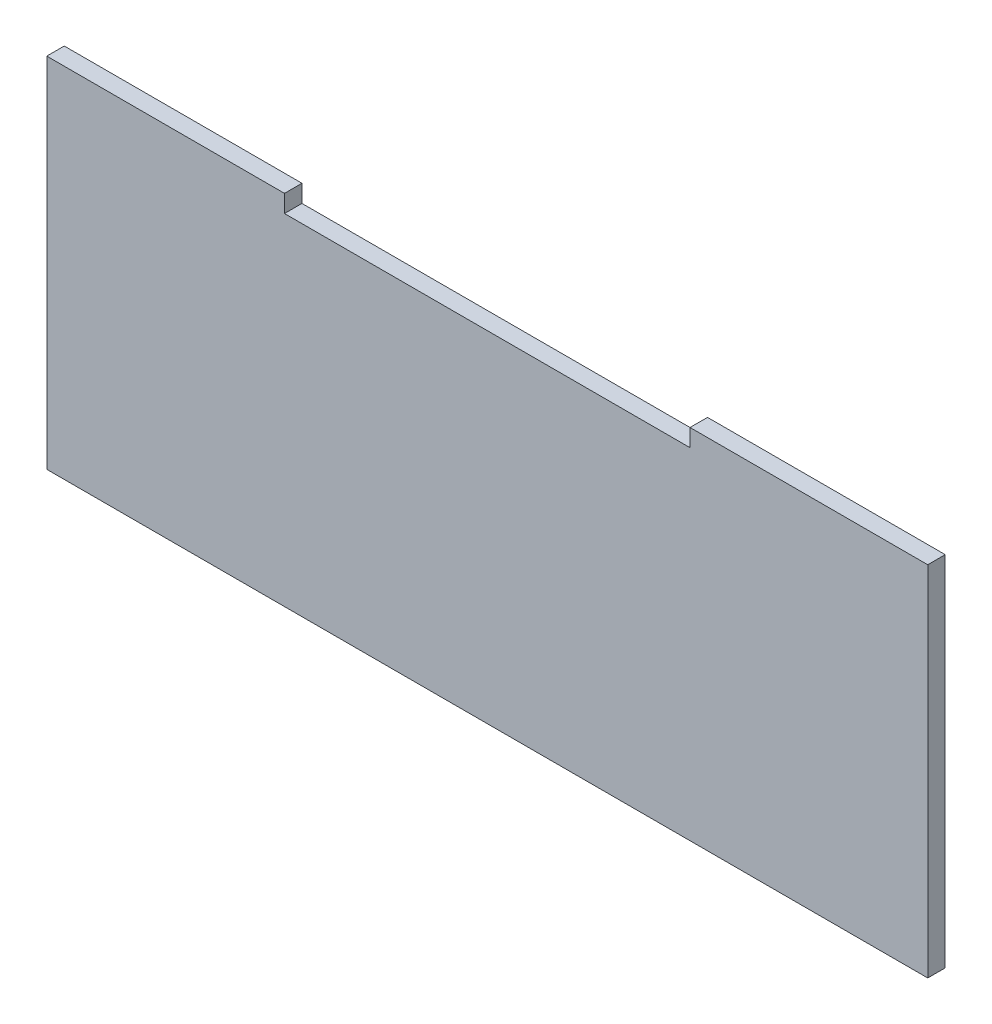
ISO-10303-21;
HEADER;
FILE_DESCRIPTION(('STEP AP214'),'2;1');
FILE_NAME('part.step','',(''),(''),'','','');
FILE_SCHEMA(('AUTOMOTIVE_DESIGN { 1 0 10303 214 1 1 1 1 }'));
ENDSEC;
DATA;
#1=APPLICATION_CONTEXT('core data for automotive mechanical design processes');
#2=APPLICATION_PROTOCOL_DEFINITION('international standard','automotive_design',2000,#1);
#3=PRODUCT_CONTEXT('',#1,'mechanical');
#4=PRODUCT('Part','Part','',(#3));
#5=PRODUCT_RELATED_PRODUCT_CATEGORY('part','',(#4));
#6=PRODUCT_DEFINITION_FORMATION('','',#4);
#7=PRODUCT_DEFINITION_CONTEXT('part definition',#1,'design');
#8=PRODUCT_DEFINITION('design','',#6,#7);
#9=PRODUCT_DEFINITION_SHAPE('','',#8);
#10=(LENGTH_UNIT() NAMED_UNIT(*) SI_UNIT(.MILLI.,.METRE.));
#11=(NAMED_UNIT(*) PLANE_ANGLE_UNIT() SI_UNIT($,.RADIAN.));
#12=(NAMED_UNIT(*) SI_UNIT($,.STERADIAN.) SOLID_ANGLE_UNIT());
#13=UNCERTAINTY_MEASURE_WITH_UNIT(LENGTH_MEASURE(1.E-05),#10,'distance_accuracy_value','');
#14=(GEOMETRIC_REPRESENTATION_CONTEXT(3) GLOBAL_UNCERTAINTY_ASSIGNED_CONTEXT((#13)) GLOBAL_UNIT_ASSIGNED_CONTEXT((#10,
#11,#12)) REPRESENTATION_CONTEXT('',''));
#15=CARTESIAN_POINT('',(0.,0.,0.));
#16=DIRECTION('',(0.,0.,1.));
#17=DIRECTION('',(1.,0.,0.));
#18=AXIS2_PLACEMENT_3D('',#15,#16,#17);
#19=CARTESIAN_POINT('',(0.,0.,3.175));
#20=DIRECTION('',(0.,1.,0.));
#21=DIRECTION('',(0.,0.,1.));
#22=AXIS2_PLACEMENT_3D('',#19,#20,#21);
#23=PLANE('',#22);
#24=DIRECTION('',(1.,0.,0.));
#25=VECTOR('',#24,1.);
#26=CARTESIAN_POINT('',(0.,0.,0.));
#27=LINE('',#26,#25);
#28=CARTESIAN_POINT('',(-80.,0.,0.));
#29=VERTEX_POINT('',#28);
#30=CARTESIAN_POINT('',(80.,0.,0.));
#31=VERTEX_POINT('',#30);
#32=EDGE_CURVE('E85',#29,#31,#27,.T.);
#33=ORIENTED_EDGE('',*,*,#32,.T.);
#34=DIRECTION('',(0.,0.,-1.));
#35=VECTOR('',#34,1.);
#36=CARTESIAN_POINT('',(80.,0.,3.175));
#37=LINE('',#36,#35);
#38=CARTESIAN_POINT('',(80.,0.,3.175));
#39=VERTEX_POINT('',#38);
#40=EDGE_CURVE('E11',#39,#31,#37,.T.);
#41=ORIENTED_EDGE('',*,*,#40,.F.);
#42=DIRECTION('',(1.,0.,0.));
#43=VECTOR('',#42,1.);
#44=CARTESIAN_POINT('',(0.,0.,3.175));
#45=LINE('',#44,#43);
#46=CARTESIAN_POINT('',(-80.,0.,3.175));
#47=VERTEX_POINT('',#46);
#48=EDGE_CURVE('E91',#47,#39,#45,.T.);
#49=ORIENTED_EDGE('',*,*,#48,.F.);
#50=DIRECTION('',(0.,0.,-1.));
#51=VECTOR('',#50,1.);
#52=CARTESIAN_POINT('',(-80.,0.,3.175));
#53=LINE('',#52,#51);
#54=EDGE_CURVE('E125',#47,#29,#53,.T.);
#55=ORIENTED_EDGE('',*,*,#54,.T.);
#56=EDGE_LOOP('',(#33,#41,#49,#55));
#57=FACE_BOUND('',#56,.T.);
#58=ADVANCED_FACE('F33',(#57),#23,.F.);
#59=CARTESIAN_POINT('',(80.,65.,3.175));
#60=DIRECTION('',(-1.,0.,0.));
#61=DIRECTION('',(0.,0.,1.));
#62=AXIS2_PLACEMENT_3D('',#59,#60,#61);
#63=PLANE('',#62);
#64=DIRECTION('',(0.,1.,0.));
#65=VECTOR('',#64,1.);
#66=CARTESIAN_POINT('',(80.,65.,0.));
#67=LINE('',#66,#65);
#68=CARTESIAN_POINT('',(80.,65.,0.));
#69=VERTEX_POINT('',#68);
#70=EDGE_CURVE('E130',#31,#69,#67,.T.);
#71=ORIENTED_EDGE('',*,*,#70,.T.);
#72=DIRECTION('',(0.,0.,-1.));
#73=VECTOR('',#72,1.);
#74=CARTESIAN_POINT('',(80.,65.,3.175));
#75=LINE('',#74,#73);
#76=CARTESIAN_POINT('',(80.,65.,3.175));
#77=VERTEX_POINT('',#76);
#78=EDGE_CURVE('E41',#77,#69,#75,.T.);
#79=ORIENTED_EDGE('',*,*,#78,.F.);
#80=DIRECTION('',(0.,1.,0.));
#81=VECTOR('',#80,1.);
#82=CARTESIAN_POINT('',(80.,65.,3.175));
#83=LINE('',#82,#81);
#84=EDGE_CURVE('E174',#39,#77,#83,.T.);
#85=ORIENTED_EDGE('',*,*,#84,.F.);
#86=ORIENTED_EDGE('',*,*,#40,.T.);
#87=EDGE_LOOP('',(#71,#79,#85,#86));
#88=FACE_BOUND('',#87,.T.);
#89=ADVANCED_FACE('F176',(#88),#63,.F.);
#90=CARTESIAN_POINT('',(36.825,65.,3.175));
#91=DIRECTION('',(0.,-1.,0.));
#92=DIRECTION('',(0.,0.,-1.));
#93=AXIS2_PLACEMENT_3D('',#90,#91,#92);
#94=PLANE('',#93);
#95=DIRECTION('',(-1.,0.,0.));
#96=VECTOR('',#95,1.);
#97=CARTESIAN_POINT('',(36.825,65.,0.));
#98=LINE('',#97,#96);
#99=CARTESIAN_POINT('',(36.825,65.,0.));
#100=VERTEX_POINT('',#99);
#101=EDGE_CURVE('E132',#69,#100,#98,.T.);
#102=ORIENTED_EDGE('',*,*,#101,.T.);
#103=DIRECTION('',(0.,0.,-1.));
#104=VECTOR('',#103,1.);
#105=CARTESIAN_POINT('',(36.825,65.,3.175));
#106=LINE('',#105,#104);
#107=CARTESIAN_POINT('',(36.825,65.,3.175));
#108=VERTEX_POINT('',#107);
#109=EDGE_CURVE('E149',#108,#100,#106,.T.);
#110=ORIENTED_EDGE('',*,*,#109,.F.);
#111=DIRECTION('',(-1.,0.,0.));
#112=VECTOR('',#111,1.);
#113=CARTESIAN_POINT('',(36.825,65.,3.175));
#114=LINE('',#113,#112);
#115=EDGE_CURVE('E158',#77,#108,#114,.T.);
#116=ORIENTED_EDGE('',*,*,#115,.F.);
#117=ORIENTED_EDGE('',*,*,#78,.T.);
#118=EDGE_LOOP('',(#102,#110,#116,#117));
#119=FACE_BOUND('',#118,.T.);
#120=ADVANCED_FACE('F156',(#119),#94,.F.);
#121=CARTESIAN_POINT('',(36.825,61.825,3.175));
#122=DIRECTION('',(1.,0.,0.));
#123=DIRECTION('',(0.,1.,0.));
#124=AXIS2_PLACEMENT_3D('',#121,#122,#123);
#125=PLANE('',#124);
#126=DIRECTION('',(0.,-1.,0.));
#127=VECTOR('',#126,1.);
#128=CARTESIAN_POINT('',(36.825,61.825,0.));
#129=LINE('',#128,#127);
#130=CARTESIAN_POINT('',(36.825,61.825,0.));
#131=VERTEX_POINT('',#130);
#132=EDGE_CURVE('E134',#100,#131,#129,.T.);
#133=ORIENTED_EDGE('',*,*,#132,.T.);
#134=DIRECTION('',(0.,0.,-1.));
#135=VECTOR('',#134,1.);
#136=CARTESIAN_POINT('',(36.825,61.825,3.175));
#137=LINE('',#136,#135);
#138=CARTESIAN_POINT('',(36.825,61.825,3.175));
#139=VERTEX_POINT('',#138);
#140=EDGE_CURVE('E146',#139,#131,#137,.T.);
#141=ORIENTED_EDGE('',*,*,#140,.F.);
#142=DIRECTION('',(0.,-1.,0.));
#143=VECTOR('',#142,1.);
#144=CARTESIAN_POINT('',(36.825,61.825,3.175));
#145=LINE('',#144,#143);
#146=EDGE_CURVE('E170',#108,#139,#145,.T.);
#147=ORIENTED_EDGE('',*,*,#146,.F.);
#148=ORIENTED_EDGE('',*,*,#109,.T.);
#149=EDGE_LOOP('',(#133,#141,#147,#148));
#150=FACE_BOUND('',#149,.T.);
#151=ADVANCED_FACE('F166',(#150),#125,.F.);
#152=CARTESIAN_POINT('',(-36.825,61.825,3.175));
#153=DIRECTION('',(0.,-1.,0.));
#154=DIRECTION('',(1.,0.,0.));
#155=AXIS2_PLACEMENT_3D('',#152,#153,#154);
#156=PLANE('',#155);
#157=DIRECTION('',(-1.,0.,0.));
#158=VECTOR('',#157,1.);
#159=CARTESIAN_POINT('',(-36.825,61.825,0.));
#160=LINE('',#159,#158);
#161=CARTESIAN_POINT('',(-36.825,61.825,0.));
#162=VERTEX_POINT('',#161);
#163=EDGE_CURVE('E136',#131,#162,#160,.T.);
#164=ORIENTED_EDGE('',*,*,#163,.T.);
#165=DIRECTION('',(0.,0.,-1.));
#166=VECTOR('',#165,1.);
#167=CARTESIAN_POINT('',(-36.825,61.825,3.175));
#168=LINE('',#167,#166);
#169=CARTESIAN_POINT('',(-36.825,61.825,3.175));
#170=VERTEX_POINT('',#169);
#171=EDGE_CURVE('E120',#170,#162,#168,.T.);
#172=ORIENTED_EDGE('',*,*,#171,.F.);
#173=DIRECTION('',(-1.,0.,0.));
#174=VECTOR('',#173,1.);
#175=CARTESIAN_POINT('',(-36.825,61.825,3.175));
#176=LINE('',#175,#174);
#177=EDGE_CURVE('E111',#139,#170,#176,.T.);
#178=ORIENTED_EDGE('',*,*,#177,.F.);
#179=ORIENTED_EDGE('',*,*,#140,.T.);
#180=EDGE_LOOP('',(#164,#172,#178,#179));
#181=FACE_BOUND('',#180,.T.);
#182=ADVANCED_FACE('F169',(#181),#156,.F.);
#183=CARTESIAN_POINT('',(-36.825,65.,3.175));
#184=DIRECTION('',(-1.,0.,0.));
#185=DIRECTION('',(0.,0.,1.));
#186=AXIS2_PLACEMENT_3D('',#183,#184,#185);
#187=PLANE('',#186);
#188=DIRECTION('',(0.,1.,0.));
#189=VECTOR('',#188,1.);
#190=CARTESIAN_POINT('',(-36.825,65.,0.));
#191=LINE('',#190,#189);
#192=CARTESIAN_POINT('',(-36.825,65.,0.));
#193=VERTEX_POINT('',#192);
#194=EDGE_CURVE('E119',#162,#193,#191,.T.);
#195=ORIENTED_EDGE('',*,*,#194,.T.);
#196=DIRECTION('',(0.,0.,-1.));
#197=VECTOR('',#196,1.);
#198=CARTESIAN_POINT('',(-36.825,65.,3.175));
#199=LINE('',#198,#197);
#200=CARTESIAN_POINT('',(-36.825,65.,3.175));
#201=VERTEX_POINT('',#200);
#202=EDGE_CURVE('E116',#201,#193,#199,.T.);
#203=ORIENTED_EDGE('',*,*,#202,.F.);
#204=DIRECTION('',(0.,1.,0.));
#205=VECTOR('',#204,1.);
#206=CARTESIAN_POINT('',(-36.825,65.,3.175));
#207=LINE('',#206,#205);
#208=EDGE_CURVE('E105',#170,#201,#207,.T.);
#209=ORIENTED_EDGE('',*,*,#208,.F.);
#210=ORIENTED_EDGE('',*,*,#171,.T.);
#211=EDGE_LOOP('',(#195,#203,#209,#210));
#212=FACE_BOUND('',#211,.T.);
#213=ADVANCED_FACE('F117',(#212),#187,.F.);
#214=CARTESIAN_POINT('',(-80.,65.,3.175));
#215=DIRECTION('',(0.,-1.,0.));
#216=DIRECTION('',(0.,0.,-1.));
#217=AXIS2_PLACEMENT_3D('',#214,#215,#216);
#218=PLANE('',#217);
#219=DIRECTION('',(-1.,0.,0.));
#220=VECTOR('',#219,1.);
#221=CARTESIAN_POINT('',(-80.,65.,0.));
#222=LINE('',#221,#220);
#223=CARTESIAN_POINT('',(-80.,65.,0.));
#224=VERTEX_POINT('',#223);
#225=EDGE_CURVE('E78',#193,#224,#222,.T.);
#226=ORIENTED_EDGE('',*,*,#225,.T.);
#227=DIRECTION('',(0.,0.,-1.));
#228=VECTOR('',#227,1.);
#229=CARTESIAN_POINT('',(-80.,65.,3.175));
#230=LINE('',#229,#228);
#231=CARTESIAN_POINT('',(-80.,65.,3.175));
#232=VERTEX_POINT('',#231);
#233=EDGE_CURVE('E121',#232,#224,#230,.T.);
#234=ORIENTED_EDGE('',*,*,#233,.F.);
#235=DIRECTION('',(-1.,0.,0.));
#236=VECTOR('',#235,1.);
#237=CARTESIAN_POINT('',(-80.,65.,3.175));
#238=LINE('',#237,#236);
#239=EDGE_CURVE('E109',#201,#232,#238,.T.);
#240=ORIENTED_EDGE('',*,*,#239,.F.);
#241=ORIENTED_EDGE('',*,*,#202,.T.);
#242=EDGE_LOOP('',(#226,#234,#240,#241));
#243=FACE_BOUND('',#242,.T.);
#244=ADVANCED_FACE('F123',(#243),#218,.F.);
#245=CARTESIAN_POINT('',(-80.,0.,3.175));
#246=DIRECTION('',(1.,0.,0.));
#247=DIRECTION('',(0.,0.,-1.));
#248=AXIS2_PLACEMENT_3D('',#245,#246,#247);
#249=PLANE('',#248);
#250=DIRECTION('',(0.,-1.,0.));
#251=VECTOR('',#250,1.);
#252=CARTESIAN_POINT('',(-80.,0.,0.));
#253=LINE('',#252,#251);
#254=EDGE_CURVE('E140',#224,#29,#253,.T.);
#255=ORIENTED_EDGE('',*,*,#254,.T.);
#256=ORIENTED_EDGE('',*,*,#54,.F.);
#257=DIRECTION('',(0.,-1.,0.));
#258=VECTOR('',#257,1.);
#259=CARTESIAN_POINT('',(-80.,0.,3.175));
#260=LINE('',#259,#258);
#261=EDGE_CURVE('E49',#232,#47,#260,.T.);
#262=ORIENTED_EDGE('',*,*,#261,.F.);
#263=ORIENTED_EDGE('',*,*,#233,.T.);
#264=EDGE_LOOP('',(#255,#256,#262,#263));
#265=FACE_BOUND('',#264,.T.);
#266=ADVANCED_FACE('F179',(#265),#249,.F.);
#267=CARTESIAN_POINT('',(0.,0.,3.175));
#268=DIRECTION('',(0.,0.,-1.));
#269=DIRECTION('',(-1.,0.,0.));
#270=AXIS2_PLACEMENT_3D('',#267,#268,#269);
#271=PLANE('',#270);
#272=ORIENTED_EDGE('',*,*,#48,.T.);
#273=ORIENTED_EDGE('',*,*,#84,.T.);
#274=ORIENTED_EDGE('',*,*,#115,.T.);
#275=ORIENTED_EDGE('',*,*,#146,.T.);
#276=ORIENTED_EDGE('',*,*,#177,.T.);
#277=ORIENTED_EDGE('',*,*,#208,.T.);
#278=ORIENTED_EDGE('',*,*,#239,.T.);
#279=ORIENTED_EDGE('',*,*,#261,.T.);
#280=EDGE_LOOP('',(#272,#273,#274,#275,#276,#277,#278,#279));
#281=FACE_BOUND('',#280,.T.);
#282=ADVANCED_FACE('F107',(#281),#271,.F.);
#283=CARTESIAN_POINT('',(0.,0.,0.));
#284=DIRECTION('',(0.,0.,-1.));
#285=DIRECTION('',(-1.,0.,0.));
#286=AXIS2_PLACEMENT_3D('',#283,#284,#285);
#287=PLANE('',#286);
#288=ORIENTED_EDGE('',*,*,#32,.F.);
#289=ORIENTED_EDGE('',*,*,#254,.F.);
#290=ORIENTED_EDGE('',*,*,#225,.F.);
#291=ORIENTED_EDGE('',*,*,#194,.F.);
#292=ORIENTED_EDGE('',*,*,#163,.F.);
#293=ORIENTED_EDGE('',*,*,#132,.F.);
#294=ORIENTED_EDGE('',*,*,#101,.F.);
#295=ORIENTED_EDGE('',*,*,#70,.F.);
#296=EDGE_LOOP('',(#288,#289,#290,#291,#292,#293,#294,#295));
#297=FACE_BOUND('',#296,.T.);
#298=ADVANCED_FACE('F162',(#297),#287,.T.);
#299=CLOSED_SHELL('',(#58,#89,#120,#151,#182,#213,#244,#266,#282,#298));
#300=MANIFOLD_SOLID_BREP('B2',#299);
#301=ADVANCED_BREP_SHAPE_REPRESENTATION('',(#18,#300),#14);
#302=SHAPE_DEFINITION_REPRESENTATION(#9,#301);
ENDSEC;
END-ISO-10303-21;
